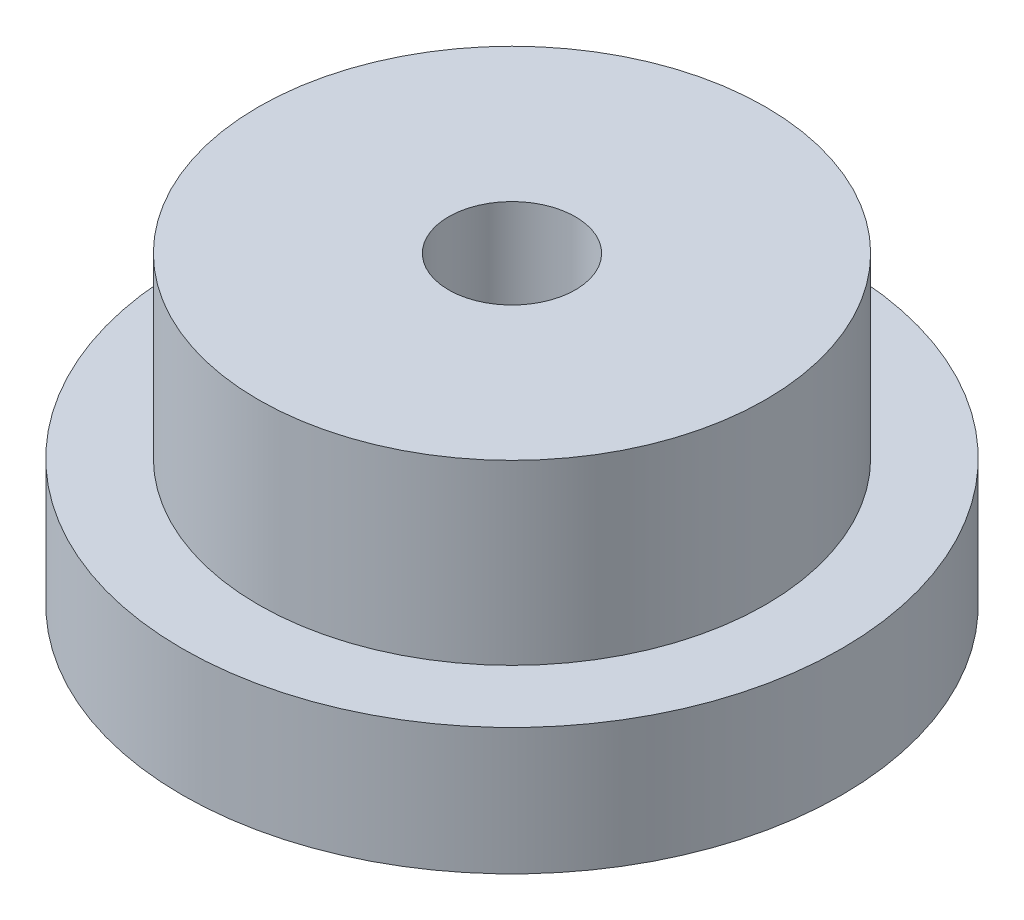
ISO-10303-21;
HEADER;
FILE_DESCRIPTION(('STEP AP214'),'2;1');
FILE_NAME('part.step','',(''),(''),'','','');
FILE_SCHEMA(('AUTOMOTIVE_DESIGN { 1 0 10303 214 1 1 1 1 }'));
ENDSEC;
DATA;
#1=APPLICATION_CONTEXT('core data for automotive mechanical design processes');
#2=APPLICATION_PROTOCOL_DEFINITION('international standard','automotive_design',2000,#1);
#3=PRODUCT_CONTEXT('',#1,'mechanical');
#4=PRODUCT('Part','Part','',(#3));
#5=PRODUCT_RELATED_PRODUCT_CATEGORY('part','',(#4));
#6=PRODUCT_DEFINITION_FORMATION('','',#4);
#7=PRODUCT_DEFINITION_CONTEXT('part definition',#1,'design');
#8=PRODUCT_DEFINITION('design','',#6,#7);
#9=PRODUCT_DEFINITION_SHAPE('','',#8);
#10=(LENGTH_UNIT() NAMED_UNIT(*) SI_UNIT(.MILLI.,.METRE.));
#11=(NAMED_UNIT(*) PLANE_ANGLE_UNIT() SI_UNIT($,.RADIAN.));
#12=(NAMED_UNIT(*) SI_UNIT($,.STERADIAN.) SOLID_ANGLE_UNIT());
#13=UNCERTAINTY_MEASURE_WITH_UNIT(LENGTH_MEASURE(1.E-05),#10,'distance_accuracy_value','');
#14=(GEOMETRIC_REPRESENTATION_CONTEXT(3) GLOBAL_UNCERTAINTY_ASSIGNED_CONTEXT((#13)) GLOBAL_UNIT_ASSIGNED_CONTEXT((#10,
#11,#12)) REPRESENTATION_CONTEXT('',''));
#15=CARTESIAN_POINT('',(0.,0.,0.));
#16=DIRECTION('',(0.,0.,1.));
#17=DIRECTION('',(1.,0.,0.));
#18=AXIS2_PLACEMENT_3D('',#15,#16,#17);
#19=CARTESIAN_POINT('',(0.,5.,0.));
#20=DIRECTION('',(0.,1.,0.));
#21=DIRECTION('',(0.,0.,1.));
#22=AXIS2_PLACEMENT_3D('',#19,#20,#21);
#23=PLANE('',#22);
#24=CARTESIAN_POINT('',(0.,5.,0.));
#25=DIRECTION('',(0.,1.,0.));
#26=DIRECTION('',(0.,0.,1.));
#27=AXIS2_PLACEMENT_3D('',#24,#25,#26);
#28=CIRCLE('',#27,10.);
#29=CARTESIAN_POINT('',(0.,5.,10.));
#30=VERTEX_POINT('',#29);
#31=EDGE_CURVE('E10',#30,#30,#28,.T.);
#32=ORIENTED_EDGE('',*,*,#31,.F.);
#33=EDGE_LOOP('',(#32));
#34=FACE_BOUND('',#33,.T.);
#35=CARTESIAN_POINT('',(0.,5.,0.));
#36=DIRECTION('',(0.,1.,0.));
#37=DIRECTION('',(0.,0.,1.));
#38=AXIS2_PLACEMENT_3D('',#35,#36,#37);
#39=CIRCLE('',#38,13.);
#40=CARTESIAN_POINT('',(0.,5.,13.));
#41=VERTEX_POINT('',#40);
#42=EDGE_CURVE('E48',#41,#41,#39,.T.);
#43=ORIENTED_EDGE('',*,*,#42,.T.);
#44=EDGE_LOOP('',(#43));
#45=FACE_BOUND('',#44,.T.);
#46=ADVANCED_FACE('F39',(#34,#45),#23,.T.);
#47=CARTESIAN_POINT('',(0.,0.,0.));
#48=DIRECTION('',(0.,1.,0.));
#49=DIRECTION('',(0.,0.,1.));
#50=AXIS2_PLACEMENT_3D('',#47,#48,#49);
#51=PLANE('',#50);
#52=CARTESIAN_POINT('',(0.,0.,0.));
#53=DIRECTION('',(0.,1.,0.));
#54=DIRECTION('',(0.,0.,1.));
#55=AXIS2_PLACEMENT_3D('',#52,#53,#54);
#56=CIRCLE('',#55,13.);
#57=CARTESIAN_POINT('',(0.,0.,13.));
#58=VERTEX_POINT('',#57);
#59=EDGE_CURVE('E43',#58,#58,#56,.T.);
#60=ORIENTED_EDGE('',*,*,#59,.F.);
#61=EDGE_LOOP('',(#60));
#62=FACE_BOUND('',#61,.T.);
#63=CARTESIAN_POINT('',(0.,0.,0.));
#64=DIRECTION('',(0.,1.,0.));
#65=DIRECTION('',(0.,0.,1.));
#66=AXIS2_PLACEMENT_3D('',#63,#64,#65);
#67=CIRCLE('',#66,2.5);
#68=CARTESIAN_POINT('',(0.,0.,2.5));
#69=VERTEX_POINT('',#68);
#70=EDGE_CURVE('E60',#69,#69,#67,.T.);
#71=ORIENTED_EDGE('',*,*,#70,.T.);
#72=EDGE_LOOP('',(#71));
#73=FACE_BOUND('',#72,.T.);
#74=ADVANCED_FACE('F91',(#62,#73),#51,.F.);
#75=CARTESIAN_POINT('',(0.,5.,0.));
#76=DIRECTION('',(0.,-1.,0.));
#77=DIRECTION('',(0.,0.,-1.));
#78=AXIS2_PLACEMENT_3D('',#75,#76,#77);
#79=CYLINDRICAL_SURFACE('',#78,13.);
#80=ORIENTED_EDGE('',*,*,#42,.F.);
#81=EDGE_LOOP('',(#80));
#82=FACE_BOUND('',#81,.T.);
#83=ORIENTED_EDGE('',*,*,#59,.T.);
#84=EDGE_LOOP('',(#83));
#85=FACE_BOUND('',#84,.T.);
#86=ADVANCED_FACE('F41',(#82,#85),#79,.T.);
#87=CARTESIAN_POINT('',(0.,5.,0.));
#88=DIRECTION('',(0.,-1.,0.));
#89=DIRECTION('',(0.,0.,-1.));
#90=AXIS2_PLACEMENT_3D('',#87,#88,#89);
#91=CYLINDRICAL_SURFACE('',#90,2.5);
#92=ORIENTED_EDGE('',*,*,#70,.F.);
#93=EDGE_LOOP('',(#92));
#94=FACE_BOUND('',#93,.T.);
#95=CARTESIAN_POINT('',(0.,12.,0.));
#96=DIRECTION('',(0.,1.,0.));
#97=DIRECTION('',(0.,0.,1.));
#98=AXIS2_PLACEMENT_3D('',#95,#96,#97);
#99=CIRCLE('',#98,2.5);
#100=CARTESIAN_POINT('',(0.,12.,2.5));
#101=VERTEX_POINT('',#100);
#102=EDGE_CURVE('E68',#101,#101,#99,.T.);
#103=ORIENTED_EDGE('',*,*,#102,.T.);
#104=EDGE_LOOP('',(#103));
#105=FACE_BOUND('',#104,.T.);
#106=ADVANCED_FACE('F78',(#94,#105),#91,.F.);
#107=CARTESIAN_POINT('',(0.,12.,0.));
#108=DIRECTION('',(0.,1.,0.));
#109=DIRECTION('',(0.,0.,1.));
#110=AXIS2_PLACEMENT_3D('',#107,#108,#109);
#111=PLANE('',#110);
#112=CARTESIAN_POINT('',(0.,12.,0.));
#113=DIRECTION('',(0.,1.,0.));
#114=DIRECTION('',(0.,0.,1.));
#115=AXIS2_PLACEMENT_3D('',#112,#113,#114);
#116=CIRCLE('',#115,10.);
#117=CARTESIAN_POINT('',(0.,12.,10.));
#118=VERTEX_POINT('',#117);
#119=EDGE_CURVE('E58',#118,#118,#116,.T.);
#120=ORIENTED_EDGE('',*,*,#119,.T.);
#121=EDGE_LOOP('',(#120));
#122=FACE_BOUND('',#121,.T.);
#123=ORIENTED_EDGE('',*,*,#102,.F.);
#124=EDGE_LOOP('',(#123));
#125=FACE_BOUND('',#124,.T.);
#126=ADVANCED_FACE('F80',(#122,#125),#111,.T.);
#127=CARTESIAN_POINT('',(0.,12.,0.));
#128=DIRECTION('',(0.,-1.,0.));
#129=DIRECTION('',(0.,0.,-1.));
#130=AXIS2_PLACEMENT_3D('',#127,#128,#129);
#131=CYLINDRICAL_SURFACE('',#130,10.);
#132=ORIENTED_EDGE('',*,*,#119,.F.);
#133=EDGE_LOOP('',(#132));
#134=FACE_BOUND('',#133,.T.);
#135=ORIENTED_EDGE('',*,*,#31,.T.);
#136=EDGE_LOOP('',(#135));
#137=FACE_BOUND('',#136,.T.);
#138=ADVANCED_FACE('F81',(#134,#137),#131,.T.);
#139=CLOSED_SHELL('',(#46,#74,#86,#106,#126,#138));
#140=MANIFOLD_SOLID_BREP('B2',#139);
#141=ADVANCED_BREP_SHAPE_REPRESENTATION('',(#18,#140),#14);
#142=SHAPE_DEFINITION_REPRESENTATION(#9,#141);
ENDSEC;
END-ISO-10303-21;
